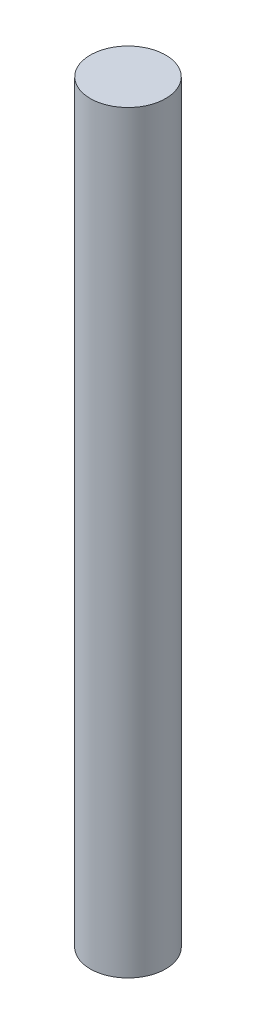
ISO-10303-21;
HEADER;
FILE_DESCRIPTION(('STEP AP214'),'2;1');
FILE_NAME('part.step','',(''),(''),'','','');
FILE_SCHEMA(('AUTOMOTIVE_DESIGN { 1 0 10303 214 1 1 1 1 }'));
ENDSEC;
DATA;
#1=APPLICATION_CONTEXT('core data for automotive mechanical design processes');
#2=APPLICATION_PROTOCOL_DEFINITION('international standard','automotive_design',2000,#1);
#3=PRODUCT_CONTEXT('',#1,'mechanical');
#4=PRODUCT('Part','Part','',(#3));
#5=PRODUCT_RELATED_PRODUCT_CATEGORY('part','',(#4));
#6=PRODUCT_DEFINITION_FORMATION('','',#4);
#7=PRODUCT_DEFINITION_CONTEXT('part definition',#1,'design');
#8=PRODUCT_DEFINITION('design','',#6,#7);
#9=PRODUCT_DEFINITION_SHAPE('','',#8);
#10=(LENGTH_UNIT() NAMED_UNIT(*) SI_UNIT(.MILLI.,.METRE.));
#11=(NAMED_UNIT(*) PLANE_ANGLE_UNIT() SI_UNIT($,.RADIAN.));
#12=(NAMED_UNIT(*) SI_UNIT($,.STERADIAN.) SOLID_ANGLE_UNIT());
#13=UNCERTAINTY_MEASURE_WITH_UNIT(LENGTH_MEASURE(1.E-05),#10,'distance_accuracy_value','');
#14=(GEOMETRIC_REPRESENTATION_CONTEXT(3) GLOBAL_UNCERTAINTY_ASSIGNED_CONTEXT((#13)) GLOBAL_UNIT_ASSIGNED_CONTEXT((#10,
#11,#12)) REPRESENTATION_CONTEXT('',''));
#15=CARTESIAN_POINT('',(0.,0.,0.));
#16=DIRECTION('',(0.,0.,1.));
#17=DIRECTION('',(1.,0.,0.));
#18=AXIS2_PLACEMENT_3D('',#15,#16,#17);
#19=CARTESIAN_POINT('',(0.,60.,0.));
#20=DIRECTION('',(0.,-1.,0.));
#21=DIRECTION('',(0.,0.,-1.));
#22=AXIS2_PLACEMENT_3D('',#19,#20,#21);
#23=CYLINDRICAL_SURFACE('',#22,3.);
#24=CARTESIAN_POINT('',(0.,60.,0.));
#25=DIRECTION('',(0.,1.,0.));
#26=DIRECTION('',(0.,0.,1.));
#27=AXIS2_PLACEMENT_3D('',#24,#25,#26);
#28=CIRCLE('',#27,3.);
#29=CARTESIAN_POINT('',(0.,60.,3.));
#30=VERTEX_POINT('',#29);
#31=EDGE_CURVE('E10',#30,#30,#28,.T.);
#32=ORIENTED_EDGE('',*,*,#31,.F.);
#33=EDGE_LOOP('',(#32));
#34=FACE_BOUND('',#33,.T.);
#35=CARTESIAN_POINT('',(0.,0.,0.));
#36=DIRECTION('',(0.,1.,0.));
#37=DIRECTION('',(0.,0.,1.));
#38=AXIS2_PLACEMENT_3D('',#35,#36,#37);
#39=CIRCLE('',#38,3.);
#40=CARTESIAN_POINT('',(0.,0.,3.));
#41=VERTEX_POINT('',#40);
#42=EDGE_CURVE('E40',#41,#41,#39,.T.);
#43=ORIENTED_EDGE('',*,*,#42,.T.);
#44=EDGE_LOOP('',(#43));
#45=FACE_BOUND('',#44,.T.);
#46=ADVANCED_FACE('F37',(#34,#45),#23,.T.);
#47=CARTESIAN_POINT('',(0.,60.,0.));
#48=DIRECTION('',(0.,1.,0.));
#49=DIRECTION('',(0.,0.,1.));
#50=AXIS2_PLACEMENT_3D('',#47,#48,#49);
#51=PLANE('',#50);
#52=ORIENTED_EDGE('',*,*,#31,.T.);
#53=EDGE_LOOP('',(#52));
#54=FACE_BOUND('',#53,.T.);
#55=ADVANCED_FACE('F52',(#54),#51,.T.);
#56=CARTESIAN_POINT('',(0.,0.,0.));
#57=DIRECTION('',(0.,1.,0.));
#58=DIRECTION('',(0.,0.,1.));
#59=AXIS2_PLACEMENT_3D('',#56,#57,#58);
#60=PLANE('',#59);
#61=ORIENTED_EDGE('',*,*,#42,.F.);
#62=EDGE_LOOP('',(#61));
#63=FACE_BOUND('',#62,.T.);
#64=ADVANCED_FACE('F50',(#63),#60,.F.);
#65=CLOSED_SHELL('',(#46,#55,#64));
#66=MANIFOLD_SOLID_BREP('B2',#65);
#67=ADVANCED_BREP_SHAPE_REPRESENTATION('',(#18,#66),#14);
#68=SHAPE_DEFINITION_REPRESENTATION(#9,#67);
ENDSEC;
END-ISO-10303-21;
